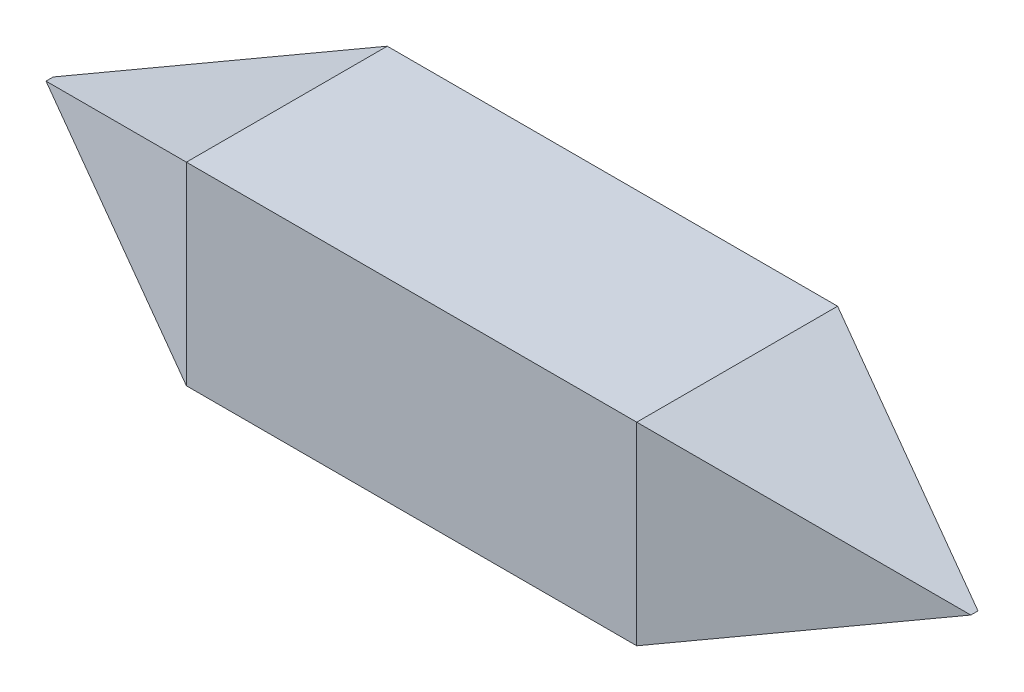
ISO-10303-21;
HEADER;
FILE_DESCRIPTION(('STEP AP214'),'2;1');
FILE_NAME('part.step','',(''),(''),'','','');
FILE_SCHEMA(('AUTOMOTIVE_DESIGN { 1 0 10303 214 1 1 1 1 }'));
ENDSEC;
DATA;
#1=APPLICATION_CONTEXT('core data for automotive mechanical design processes');
#2=APPLICATION_PROTOCOL_DEFINITION('international standard','automotive_design',2000,#1);
#3=PRODUCT_CONTEXT('',#1,'mechanical');
#4=PRODUCT('Part','Part','',(#3));
#5=PRODUCT_RELATED_PRODUCT_CATEGORY('part','',(#4));
#6=PRODUCT_DEFINITION_FORMATION('','',#4);
#7=PRODUCT_DEFINITION_CONTEXT('part definition',#1,'design');
#8=PRODUCT_DEFINITION('design','',#6,#7);
#9=PRODUCT_DEFINITION_SHAPE('','',#8);
#10=(LENGTH_UNIT() NAMED_UNIT(*) SI_UNIT(.MILLI.,.METRE.));
#11=(NAMED_UNIT(*) PLANE_ANGLE_UNIT() SI_UNIT($,.RADIAN.));
#12=(NAMED_UNIT(*) SI_UNIT($,.STERADIAN.) SOLID_ANGLE_UNIT());
#13=UNCERTAINTY_MEASURE_WITH_UNIT(LENGTH_MEASURE(1.E-05),#10,'distance_accuracy_value','');
#14=(GEOMETRIC_REPRESENTATION_CONTEXT(3) GLOBAL_UNCERTAINTY_ASSIGNED_CONTEXT((#13)) GLOBAL_UNIT_ASSIGNED_CONTEXT((#10,
#11,#12)) REPRESENTATION_CONTEXT('',''));
#15=CARTESIAN_POINT('',(0.,0.,0.));
#16=DIRECTION('',(0.,0.,1.));
#17=DIRECTION('',(1.,0.,0.));
#18=AXIS2_PLACEMENT_3D('',#15,#16,#17);
#19=CARTESIAN_POINT('',(0.,430.1,-2.676));
#20=DIRECTION('',(-0.377937741687457,0.925831012338745,0.));
#21=DIRECTION('',(-0.925831012338745,-0.377937741687457,0.));
#22=AXIS2_PLACEMENT_3D('',#19,#20,#21);
#23=PLANE('',#22);
#24=DIRECTION('',(-0.866043267642828,-0.353531510985258,-0.353531511058086));
#25=VECTOR('',#24,1.);
#26=CARTESIAN_POINT('',(0.,430.099999893335,446.));
#27=LINE('',#26,#25);
#28=CARTESIAN_POINT('',(6.53240827153068E-08,430.099999933335,446.000000013333));
#29=VERTEX_POINT('',#28);
#30=CARTESIAN_POINT('',(-526.806236127808,215.049999982122,230.949999967549));
#31=VERTEX_POINT('',#30);
#32=EDGE_CURVE('E21',#29,#31,#27,.T.);
#33=ORIENTED_EDGE('',*,*,#32,.F.);
#34=DIRECTION('',(0.,0.,-1.));
#35=VECTOR('',#34,1.);
#36=CARTESIAN_POINT('',(0.,430.1,223.));
#37=LINE('',#36,#35);
#38=CARTESIAN_POINT('',(6.53238574344073E-08,430.099999933335,-1.33330846363577E-08));
#39=VERTEX_POINT('',#38);
#40=EDGE_CURVE('E69',#29,#39,#37,.T.);
#41=ORIENTED_EDGE('',*,*,#40,.T.);
#42=DIRECTION('',(0.866043267642828,0.353531510985258,-0.353531511058086));
#43=VECTOR('',#42,1.);
#44=CARTESIAN_POINT('',(-526.80623601323,215.05,215.049999937635));
#45=LINE('',#44,#43);
#46=CARTESIAN_POINT('',(-526.806236127807,215.049999982122,215.050000032451));
#47=VERTEX_POINT('',#46);
#48=EDGE_CURVE('E111',#47,#39,#45,.T.);
#49=ORIENTED_EDGE('',*,*,#48,.F.);
#50=DIRECTION('',(0.,0.,-1.));
#51=VECTOR('',#50,1.);
#52=CARTESIAN_POINT('',(-526.806236166,215.05,223.));
#53=LINE('',#52,#51);
#54=EDGE_CURVE('E93',#31,#47,#53,.T.);
#55=ORIENTED_EDGE('',*,*,#54,.F.);
#56=EDGE_LOOP('',(#33,#41,#49,#55));
#57=FACE_BOUND('',#56,.T.);
#58=ADVANCED_FACE('F17',(#57),#23,.T.);
#59=CARTESIAN_POINT('',(-529.967073583,-2.5806,229.6597));
#60=DIRECTION('',(-0.377937741687454,0.,0.925831012338746));
#61=DIRECTION('',(0.925831012338746,0.,0.377937741687454));
#62=AXIS2_PLACEMENT_3D('',#59,#60,#61);
#63=PLANE('',#62);
#64=ORIENTED_EDGE('',*,*,#32,.T.);
#65=DIRECTION('',(-0.86604326764396,0.35353151105855,-0.353531510982021));
#66=VECTOR('',#65,1.);
#67=CARTESIAN_POINT('',(0.,0.,445.999999889392));
#68=LINE('',#67,#66);
#69=CARTESIAN_POINT('',(6.77390281244637E-08,-1.38260147215049E-08,445.99999993087));
#70=VERTEX_POINT('',#69);
#71=EDGE_CURVE('E89',#70,#31,#68,.T.);
#72=ORIENTED_EDGE('',*,*,#71,.F.);
#73=DIRECTION('',(0.,1.,0.));
#74=VECTOR('',#73,1.);
#75=CARTESIAN_POINT('',(0.,215.05,446.));
#76=LINE('',#75,#74);
#77=EDGE_CURVE('E85',#70,#29,#76,.T.);
#78=ORIENTED_EDGE('',*,*,#77,.T.);
#79=EDGE_LOOP('',(#64,#72,#78));
#80=FACE_BOUND('',#79,.T.);
#81=ADVANCED_FACE('F97',(#80),#63,.T.);
#82=CARTESIAN_POINT('',(1526.806236166,215.05,-2.676));
#83=DIRECTION('',(0.377937741687457,0.925831012338745,0.));
#84=DIRECTION('',(-0.925831012338745,0.377937741687457,0.));
#85=AXIS2_PLACEMENT_3D('',#82,#83,#84);
#86=PLANE('',#85);
#87=DIRECTION('',(0.,0.,1.));
#88=VECTOR('',#87,1.);
#89=CARTESIAN_POINT('',(1000.,430.1,223.));
#90=LINE('',#89,#88);
#91=CARTESIAN_POINT('',(999.999999934676,430.099999933335,-1.33330804916936E-08));
#92=VERTEX_POINT('',#91);
#93=CARTESIAN_POINT('',(999.999999934676,430.099999933335,446.000000013333));
#94=VERTEX_POINT('',#93);
#95=EDGE_CURVE('E78',#92,#94,#90,.T.);
#96=ORIENTED_EDGE('',*,*,#95,.T.);
#97=DIRECTION('',(-0.866043267642828,0.353531510985258,0.353531511058086));
#98=VECTOR('',#97,1.);
#99=CARTESIAN_POINT('',(1526.80623601323,215.05,230.950000062365));
#100=LINE('',#99,#98);
#101=CARTESIAN_POINT('',(1526.80623612781,215.049999982122,230.949999967549));
#102=VERTEX_POINT('',#101);
#103=EDGE_CURVE('E96',#102,#94,#100,.T.);
#104=ORIENTED_EDGE('',*,*,#103,.F.);
#105=DIRECTION('',(0.,0.,1.));
#106=VECTOR('',#105,1.);
#107=CARTESIAN_POINT('',(1526.806236166,215.05,223.));
#108=LINE('',#107,#106);
#109=CARTESIAN_POINT('',(1526.80623612781,215.049999982122,215.050000032451));
#110=VERTEX_POINT('',#109);
#111=EDGE_CURVE('E102',#110,#102,#108,.T.);
#112=ORIENTED_EDGE('',*,*,#111,.F.);
#113=DIRECTION('',(0.866043267642828,-0.353531510985258,0.353531511058086));
#114=VECTOR('',#113,1.);
#115=CARTESIAN_POINT('',(1000.,430.099999893335,0.));
#116=LINE('',#115,#114);
#117=EDGE_CURVE('E77',#92,#110,#116,.T.);
#118=ORIENTED_EDGE('',*,*,#117,.F.);
#119=EDGE_LOOP('',(#96,#104,#112,#118));
#120=FACE_BOUND('',#119,.T.);
#121=ADVANCED_FACE('F137',(#120),#86,.T.);
#122=CARTESIAN_POINT('',(1000.,-2.5806,446.));
#123=DIRECTION('',(0.377937741687454,0.,0.925831012338746));
#124=DIRECTION('',(0.925831012338746,0.,-0.377937741687454));
#125=AXIS2_PLACEMENT_3D('',#122,#123,#124);
#126=PLANE('',#125);
#127=DIRECTION('',(-0.86604326764396,-0.35353151105855,0.353531510982021));
#128=VECTOR('',#127,1.);
#129=CARTESIAN_POINT('',(1526.80623605326,215.049999953978,230.949999981966));
#130=LINE('',#129,#128);
#131=CARTESIAN_POINT('',(999.999999932261,-1.38260861093364E-08,445.99999993087));
#132=VERTEX_POINT('',#131);
#133=EDGE_CURVE('E109',#102,#132,#130,.T.);
#134=ORIENTED_EDGE('',*,*,#133,.F.);
#135=ORIENTED_EDGE('',*,*,#103,.T.);
#136=DIRECTION('',(0.,-1.,0.));
#137=VECTOR('',#136,1.);
#138=CARTESIAN_POINT('',(1000.,215.05,446.));
#139=LINE('',#138,#137);
#140=EDGE_CURVE('E88',#94,#132,#139,.T.);
#141=ORIENTED_EDGE('',*,*,#140,.T.);
#142=EDGE_LOOP('',(#134,#135,#141));
#143=FACE_BOUND('',#142,.T.);
#144=ADVANCED_FACE('F132',(#143),#126,.T.);
#145=CARTESIAN_POINT('',(0.,-2.5806,0.));
#146=DIRECTION('',(-0.377937741687454,0.,-0.925831012338746));
#147=DIRECTION('',(-0.925831012338746,0.,0.377937741687454));
#148=AXIS2_PLACEMENT_3D('',#145,#146,#147);
#149=PLANE('',#148);
#150=DIRECTION('',(0.86604326764396,-0.35353151105855,-0.353531510982021));
#151=VECTOR('',#150,1.);
#152=CARTESIAN_POINT('',(-526.806236053259,215.049999953978,215.050000018033));
#153=LINE('',#152,#151);
#154=CARTESIAN_POINT('',(6.773895333545E-08,-1.38260097815035E-08,6.91299725796846E-08));
#155=VERTEX_POINT('',#154);
#156=EDGE_CURVE('E107',#47,#155,#153,.T.);
#157=ORIENTED_EDGE('',*,*,#156,.F.);
#158=ORIENTED_EDGE('',*,*,#48,.T.);
#159=DIRECTION('',(0.,1.,0.));
#160=VECTOR('',#159,1.);
#161=CARTESIAN_POINT('',(0.,215.05,0.));
#162=LINE('',#161,#160);
#163=EDGE_CURVE('E113',#155,#39,#162,.T.);
#164=ORIENTED_EDGE('',*,*,#163,.F.);
#165=EDGE_LOOP('',(#157,#158,#164));
#166=FACE_BOUND('',#165,.T.);
#167=ADVANCED_FACE('F143',(#166),#149,.T.);
#168=CARTESIAN_POINT('',(0.,430.1,446.));
#169=DIRECTION('',(0.,-1.,0.));
#170=DIRECTION('',(0.,0.,-1.));
#171=AXIS2_PLACEMENT_3D('',#168,#169,#170);
#172=PLANE('',#171);
#173=ORIENTED_EDGE('',*,*,#40,.F.);
#174=DIRECTION('',(1.,0.,0.));
#175=VECTOR('',#174,1.);
#176=CARTESIAN_POINT('',(500.,430.1,446.));
#177=LINE('',#176,#175);
#178=EDGE_CURVE('E72',#29,#94,#177,.T.);
#179=ORIENTED_EDGE('',*,*,#178,.T.);
#180=ORIENTED_EDGE('',*,*,#95,.F.);
#181=DIRECTION('',(1.,0.,0.));
#182=VECTOR('',#181,1.);
#183=CARTESIAN_POINT('',(500.,430.1,0.));
#184=LINE('',#183,#182);
#185=EDGE_CURVE('E73',#39,#92,#184,.T.);
#186=ORIENTED_EDGE('',*,*,#185,.F.);
#187=EDGE_LOOP('',(#173,#179,#180,#186));
#188=FACE_BOUND('',#187,.T.);
#189=ADVANCED_FACE('F71',(#188),#172,.F.);
#190=CARTESIAN_POINT('',(1529.967073583,-2.5806,216.3403));
#191=DIRECTION('',(0.377937741687454,0.,-0.925831012338746));
#192=DIRECTION('',(-0.925831012338746,0.,-0.377937741687454));
#193=AXIS2_PLACEMENT_3D('',#190,#191,#192);
#194=PLANE('',#193);
#195=ORIENTED_EDGE('',*,*,#117,.T.);
#196=DIRECTION('',(0.86604326764396,0.35353151105855,0.353531510982021));
#197=VECTOR('',#196,1.);
#198=CARTESIAN_POINT('',(1000.,0.,1.10607999755791E-07));
#199=LINE('',#198,#197);
#200=CARTESIAN_POINT('',(999.999999932261,-1.38259893445519E-08,6.91300231604494E-08));
#201=VERTEX_POINT('',#200);
#202=EDGE_CURVE('E99',#201,#110,#199,.T.);
#203=ORIENTED_EDGE('',*,*,#202,.F.);
#204=DIRECTION('',(0.,-1.,0.));
#205=VECTOR('',#204,1.);
#206=CARTESIAN_POINT('',(1000.,215.05,0.));
#207=LINE('',#206,#205);
#208=EDGE_CURVE('E35',#92,#201,#207,.T.);
#209=ORIENTED_EDGE('',*,*,#208,.F.);
#210=EDGE_LOOP('',(#195,#203,#209));
#211=FACE_BOUND('',#210,.T.);
#212=ADVANCED_FACE('F151',(#211),#194,.T.);
#213=CARTESIAN_POINT('',(-526.806236166,215.05,-2.676));
#214=DIRECTION('',(-0.377937741687457,-0.925831012338745,0.));
#215=DIRECTION('',(0.925831012338745,-0.377937741687457,0.));
#216=AXIS2_PLACEMENT_3D('',#213,#214,#215);
#217=PLANE('',#216);
#218=DIRECTION('',(0.,0.,1.));
#219=VECTOR('',#218,1.);
#220=CARTESIAN_POINT('',(0.,0.,223.));
#221=LINE('',#220,#219);
#222=EDGE_CURVE('E118',#155,#70,#221,.T.);
#223=ORIENTED_EDGE('',*,*,#222,.T.);
#224=ORIENTED_EDGE('',*,*,#71,.T.);
#225=ORIENTED_EDGE('',*,*,#54,.T.);
#226=ORIENTED_EDGE('',*,*,#156,.T.);
#227=EDGE_LOOP('',(#223,#224,#225,#226));
#228=FACE_BOUND('',#227,.T.);
#229=ADVANCED_FACE('F146',(#228),#217,.T.);
#230=CARTESIAN_POINT('',(1000.,0.,446.));
#231=DIRECTION('',(0.,0.,-1.));
#232=DIRECTION('',(-1.,0.,0.));
#233=AXIS2_PLACEMENT_3D('',#230,#231,#232);
#234=PLANE('',#233);
#235=DIRECTION('',(1.,0.,0.));
#236=VECTOR('',#235,1.);
#237=CARTESIAN_POINT('',(500.,0.,446.));
#238=LINE('',#237,#236);
#239=EDGE_CURVE('E119',#70,#132,#238,.T.);
#240=ORIENTED_EDGE('',*,*,#239,.T.);
#241=ORIENTED_EDGE('',*,*,#140,.F.);
#242=ORIENTED_EDGE('',*,*,#178,.F.);
#243=ORIENTED_EDGE('',*,*,#77,.F.);
#244=EDGE_LOOP('',(#240,#241,#242,#243));
#245=FACE_BOUND('',#244,.T.);
#246=ADVANCED_FACE('F83',(#245),#234,.F.);
#247=CARTESIAN_POINT('',(1000.,0.,-2.676));
#248=DIRECTION('',(0.377937741687457,-0.925831012338745,0.));
#249=DIRECTION('',(0.925831012338745,0.377937741687457,0.));
#250=AXIS2_PLACEMENT_3D('',#247,#248,#249);
#251=PLANE('',#250);
#252=ORIENTED_EDGE('',*,*,#133,.T.);
#253=DIRECTION('',(0.,0.,-1.));
#254=VECTOR('',#253,1.);
#255=CARTESIAN_POINT('',(1000.,0.,223.));
#256=LINE('',#255,#254);
#257=EDGE_CURVE('E27',#132,#201,#256,.T.);
#258=ORIENTED_EDGE('',*,*,#257,.T.);
#259=ORIENTED_EDGE('',*,*,#202,.T.);
#260=ORIENTED_EDGE('',*,*,#111,.T.);
#261=EDGE_LOOP('',(#252,#258,#259,#260));
#262=FACE_BOUND('',#261,.T.);
#263=ADVANCED_FACE('F149',(#262),#251,.T.);
#264=CARTESIAN_POINT('',(1000.,0.,0.));
#265=DIRECTION('',(0.,0.,-1.));
#266=DIRECTION('',(-1.,0.,0.));
#267=AXIS2_PLACEMENT_3D('',#264,#265,#266);
#268=PLANE('',#267);
#269=ORIENTED_EDGE('',*,*,#208,.T.);
#270=DIRECTION('',(-1.,0.,0.));
#271=VECTOR('',#270,1.);
#272=CARTESIAN_POINT('',(500.,0.,0.));
#273=LINE('',#272,#271);
#274=EDGE_CURVE('E11',#201,#155,#273,.T.);
#275=ORIENTED_EDGE('',*,*,#274,.T.);
#276=ORIENTED_EDGE('',*,*,#163,.T.);
#277=ORIENTED_EDGE('',*,*,#185,.T.);
#278=EDGE_LOOP('',(#269,#275,#276,#277));
#279=FACE_BOUND('',#278,.T.);
#280=ADVANCED_FACE('F138',(#279),#268,.T.);
#281=CARTESIAN_POINT('',(0.,0.,0.));
#282=DIRECTION('',(0.,1.,0.));
#283=DIRECTION('',(0.,0.,1.));
#284=AXIS2_PLACEMENT_3D('',#281,#282,#283);
#285=PLANE('',#284);
#286=ORIENTED_EDGE('',*,*,#257,.F.);
#287=ORIENTED_EDGE('',*,*,#239,.F.);
#288=ORIENTED_EDGE('',*,*,#222,.F.);
#289=ORIENTED_EDGE('',*,*,#274,.F.);
#290=EDGE_LOOP('',(#286,#287,#288,#289));
#291=FACE_BOUND('',#290,.T.);
#292=ADVANCED_FACE('F19',(#291),#285,.F.);
#293=CLOSED_SHELL('',(#58,#81,#121,#144,#167,#189,#212,#229,#246,#263,#280,#292));
#294=MANIFOLD_SOLID_BREP('B1',#293);
#295=ADVANCED_BREP_SHAPE_REPRESENTATION('',(#18,#294),#14);
#296=SHAPE_DEFINITION_REPRESENTATION(#9,#295);
ENDSEC;
END-ISO-10303-21;
